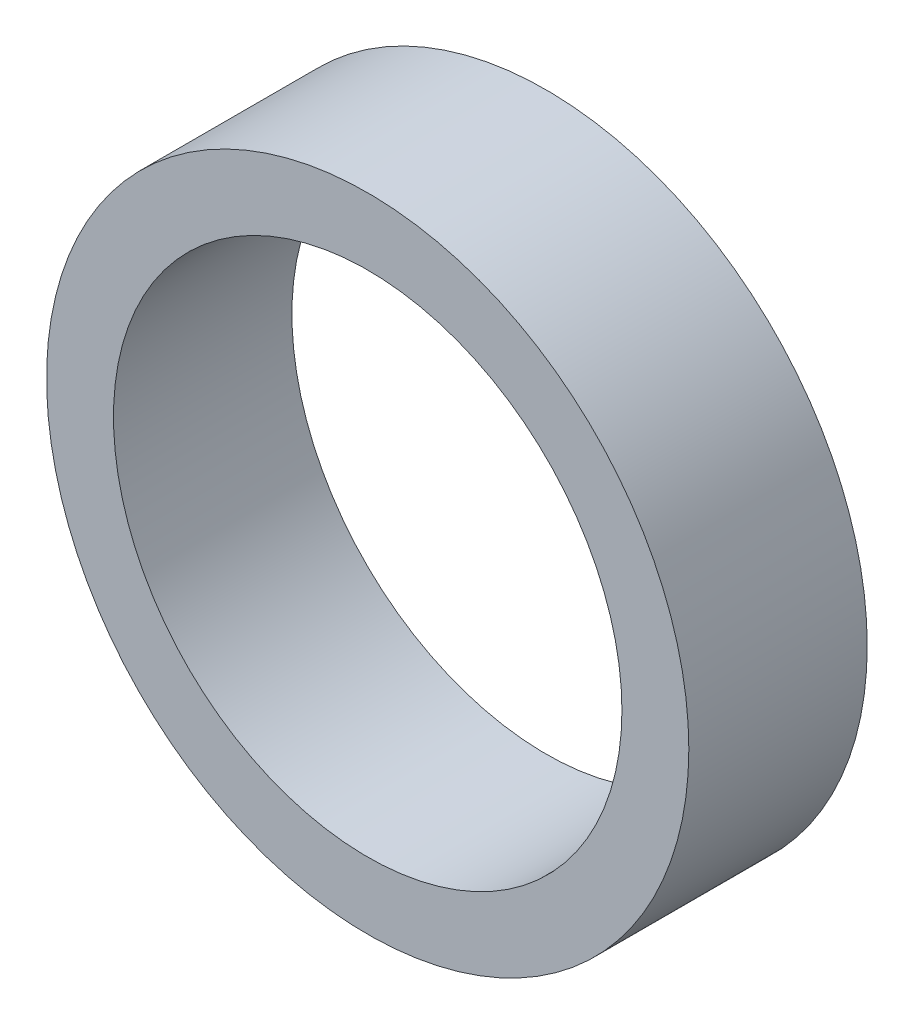
ISO-10303-21;
HEADER;
FILE_DESCRIPTION(('STEP AP214'),'2;1');
FILE_NAME('part.step','',(''),(''),'','','');
FILE_SCHEMA(('AUTOMOTIVE_DESIGN { 1 0 10303 214 1 1 1 1 }'));
ENDSEC;
DATA;
#1=APPLICATION_CONTEXT('core data for automotive mechanical design processes');
#2=APPLICATION_PROTOCOL_DEFINITION('international standard','automotive_design',2000,#1);
#3=PRODUCT_CONTEXT('',#1,'mechanical');
#4=PRODUCT('Part','Part','',(#3));
#5=PRODUCT_RELATED_PRODUCT_CATEGORY('part','',(#4));
#6=PRODUCT_DEFINITION_FORMATION('','',#4);
#7=PRODUCT_DEFINITION_CONTEXT('part definition',#1,'design');
#8=PRODUCT_DEFINITION('design','',#6,#7);
#9=PRODUCT_DEFINITION_SHAPE('','',#8);
#10=(LENGTH_UNIT() NAMED_UNIT(*) SI_UNIT(.MILLI.,.METRE.));
#11=(NAMED_UNIT(*) PLANE_ANGLE_UNIT() SI_UNIT($,.RADIAN.));
#12=(NAMED_UNIT(*) SI_UNIT($,.STERADIAN.) SOLID_ANGLE_UNIT());
#13=UNCERTAINTY_MEASURE_WITH_UNIT(LENGTH_MEASURE(1.E-05),#10,'distance_accuracy_value','');
#14=(GEOMETRIC_REPRESENTATION_CONTEXT(3) GLOBAL_UNCERTAINTY_ASSIGNED_CONTEXT((#13)) GLOBAL_UNIT_ASSIGNED_CONTEXT((#10,
#11,#12)) REPRESENTATION_CONTEXT('',''));
#15=CARTESIAN_POINT('',(0.,0.,0.));
#16=DIRECTION('',(0.,0.,1.));
#17=DIRECTION('',(1.,0.,0.));
#18=AXIS2_PLACEMENT_3D('',#15,#16,#17);
#19=CARTESIAN_POINT('',(0.,0.,5.));
#20=DIRECTION('',(0.,0.,1.));
#21=DIRECTION('',(1.,0.,0.));
#22=AXIS2_PLACEMENT_3D('',#19,#20,#21);
#23=PLANE('',#22);
#24=CARTESIAN_POINT('',(0.,0.,5.));
#25=DIRECTION('',(0.,0.,1.));
#26=DIRECTION('',(1.,0.,0.));
#27=AXIS2_PLACEMENT_3D('',#24,#25,#26);
#28=CIRCLE('',#27,18.);
#29=CARTESIAN_POINT('',(18.,0.,5.));
#30=VERTEX_POINT('',#29);
#31=EDGE_CURVE('E10',#30,#30,#28,.T.);
#32=ORIENTED_EDGE('',*,*,#31,.T.);
#33=EDGE_LOOP('',(#32));
#34=FACE_BOUND('',#33,.T.);
#35=CARTESIAN_POINT('',(0.,0.,5.));
#36=DIRECTION('',(0.,0.,1.));
#37=DIRECTION('',(1.,0.,0.));
#38=AXIS2_PLACEMENT_3D('',#35,#36,#37);
#39=CIRCLE('',#38,14.25);
#40=CARTESIAN_POINT('',(14.25,0.,5.));
#41=VERTEX_POINT('',#40);
#42=EDGE_CURVE('E35',#41,#41,#39,.T.);
#43=ORIENTED_EDGE('',*,*,#42,.F.);
#44=EDGE_LOOP('',(#43));
#45=FACE_BOUND('',#44,.T.);
#46=ADVANCED_FACE('F24',(#34,#45),#23,.T.);
#47=CARTESIAN_POINT('',(0.,0.,-5.));
#48=DIRECTION('',(0.,0.,1.));
#49=DIRECTION('',(1.,0.,0.));
#50=AXIS2_PLACEMENT_3D('',#47,#48,#49);
#51=PLANE('',#50);
#52=CARTESIAN_POINT('',(0.,0.,-5.));
#53=DIRECTION('',(0.,0.,1.));
#54=DIRECTION('',(1.,0.,0.));
#55=AXIS2_PLACEMENT_3D('',#52,#53,#54);
#56=CIRCLE('',#55,18.);
#57=CARTESIAN_POINT('',(18.,0.,-5.));
#58=VERTEX_POINT('',#57);
#59=EDGE_CURVE('E31',#58,#58,#56,.T.);
#60=ORIENTED_EDGE('',*,*,#59,.F.);
#61=EDGE_LOOP('',(#60));
#62=FACE_BOUND('',#61,.T.);
#63=CARTESIAN_POINT('',(0.,0.,-5.));
#64=DIRECTION('',(0.,0.,1.));
#65=DIRECTION('',(1.,0.,0.));
#66=AXIS2_PLACEMENT_3D('',#63,#64,#65);
#67=CIRCLE('',#66,14.25);
#68=CARTESIAN_POINT('',(14.25,0.,-5.));
#69=VERTEX_POINT('',#68);
#70=EDGE_CURVE('E39',#69,#69,#67,.T.);
#71=ORIENTED_EDGE('',*,*,#70,.T.);
#72=EDGE_LOOP('',(#71));
#73=FACE_BOUND('',#72,.T.);
#74=ADVANCED_FACE('F45',(#62,#73),#51,.F.);
#75=CARTESIAN_POINT('',(0.,0.,5.));
#76=DIRECTION('',(0.,0.,-1.));
#77=DIRECTION('',(-1.,0.,0.));
#78=AXIS2_PLACEMENT_3D('',#75,#76,#77);
#79=CYLINDRICAL_SURFACE('',#78,18.);
#80=ORIENTED_EDGE('',*,*,#31,.F.);
#81=EDGE_LOOP('',(#80));
#82=FACE_BOUND('',#81,.T.);
#83=ORIENTED_EDGE('',*,*,#59,.T.);
#84=EDGE_LOOP('',(#83));
#85=FACE_BOUND('',#84,.T.);
#86=ADVANCED_FACE('F26',(#82,#85),#79,.T.);
#87=CARTESIAN_POINT('',(0.,0.,5.));
#88=DIRECTION('',(0.,0.,-1.));
#89=DIRECTION('',(-1.,0.,0.));
#90=AXIS2_PLACEMENT_3D('',#87,#88,#89);
#91=CYLINDRICAL_SURFACE('',#90,14.25);
#92=ORIENTED_EDGE('',*,*,#42,.T.);
#93=EDGE_LOOP('',(#92));
#94=FACE_BOUND('',#93,.T.);
#95=ORIENTED_EDGE('',*,*,#70,.F.);
#96=EDGE_LOOP('',(#95));
#97=FACE_BOUND('',#96,.T.);
#98=ADVANCED_FACE('F47',(#94,#97),#91,.F.);
#99=CLOSED_SHELL('',(#46,#74,#86,#98));
#100=MANIFOLD_SOLID_BREP('B2',#99);
#101=ADVANCED_BREP_SHAPE_REPRESENTATION('',(#18,#100),#14);
#102=SHAPE_DEFINITION_REPRESENTATION(#9,#101);
ENDSEC;
END-ISO-10303-21;
